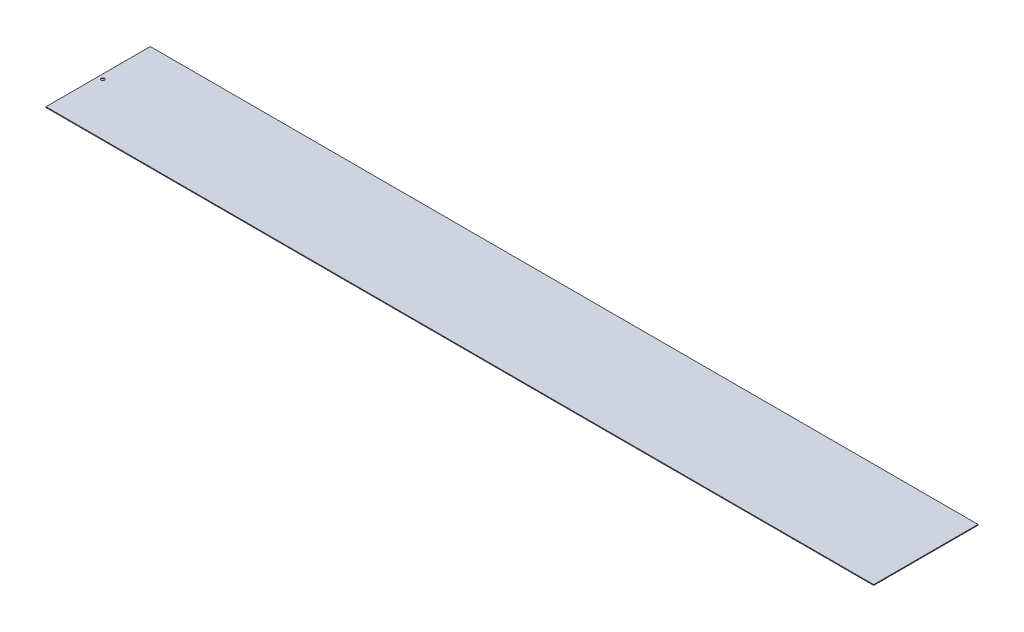
ISO-10303-21;
HEADER;
FILE_DESCRIPTION(('STEP AP214'),'2;1');
FILE_NAME('part.step','',(''),(''),'','','');
FILE_SCHEMA(('AUTOMOTIVE_DESIGN { 1 0 10303 214 1 1 1 1 }'));
ENDSEC;
DATA;
#1=APPLICATION_CONTEXT('core data for automotive mechanical design processes');
#2=APPLICATION_PROTOCOL_DEFINITION('international standard','automotive_design',2000,#1);
#3=PRODUCT_CONTEXT('',#1,'mechanical');
#4=PRODUCT('Part','Part','',(#3));
#5=PRODUCT_RELATED_PRODUCT_CATEGORY('part','',(#4));
#6=PRODUCT_DEFINITION_FORMATION('','',#4);
#7=PRODUCT_DEFINITION_CONTEXT('part definition',#1,'design');
#8=PRODUCT_DEFINITION('design','',#6,#7);
#9=PRODUCT_DEFINITION_SHAPE('','',#8);
#10=(LENGTH_UNIT() NAMED_UNIT(*) SI_UNIT(.MILLI.,.METRE.));
#11=(NAMED_UNIT(*) PLANE_ANGLE_UNIT() SI_UNIT($,.RADIAN.));
#12=(NAMED_UNIT(*) SI_UNIT($,.STERADIAN.) SOLID_ANGLE_UNIT());
#13=UNCERTAINTY_MEASURE_WITH_UNIT(LENGTH_MEASURE(1.E-05),#10,'distance_accuracy_value','');
#14=(GEOMETRIC_REPRESENTATION_CONTEXT(3) GLOBAL_UNCERTAINTY_ASSIGNED_CONTEXT((#13)) GLOBAL_UNIT_ASSIGNED_CONTEXT((#10,
#11,#12)) REPRESENTATION_CONTEXT('',''));
#15=CARTESIAN_POINT('',(0.,0.,0.));
#16=DIRECTION('',(0.,0.,1.));
#17=DIRECTION('',(1.,0.,0.));
#18=AXIS2_PLACEMENT_3D('',#15,#16,#17);
#19=CARTESIAN_POINT('',(475.728066955283,297.808823529412,200.));
#20=DIRECTION('',(0.,0.,-1.));
#21=DIRECTION('',(-1.,0.,0.));
#22=AXIS2_PLACEMENT_3D('',#19,#20,#21);
#23=PLANE('',#22);
#24=DIRECTION('',(-1.,0.,0.));
#25=VECTOR('',#24,1.);
#26=CARTESIAN_POINT('',(475.728066955283,298.558823529412,200.));
#27=LINE('',#26,#25);
#28=CARTESIAN_POINT('',(-293.006306293609,298.558823529412,200.));
#29=VERTEX_POINT('',#28);
#30=CARTESIAN_POINT('',(1294.40245047959,298.558823529412,200.));
#31=VERTEX_POINT('',#30);
#32=EDGE_CURVE('E64',#29,#31,#27,.F.);
#33=ORIENTED_EDGE('',*,*,#32,.F.);
#34=DIRECTION('',(0.,1.,0.));
#35=VECTOR('',#34,1.);
#36=CARTESIAN_POINT('',(-293.006306293609,298.558823529412,200.));
#37=LINE('',#36,#35);
#38=CARTESIAN_POINT('',(-293.006306293609,297.058823529412,200.));
#39=VERTEX_POINT('',#38);
#40=EDGE_CURVE('E133',#39,#29,#37,.T.);
#41=ORIENTED_EDGE('',*,*,#40,.F.);
#42=DIRECTION('',(-1.,0.,0.));
#43=VECTOR('',#42,1.);
#44=CARTESIAN_POINT('',(475.728066955283,297.058823529412,200.));
#45=LINE('',#44,#43);
#46=CARTESIAN_POINT('',(1294.40245047959,297.058823529412,200.));
#47=VERTEX_POINT('',#46);
#48=EDGE_CURVE('E90',#39,#47,#45,.F.);
#49=ORIENTED_EDGE('',*,*,#48,.T.);
#50=DIRECTION('',(0.,1.,0.));
#51=VECTOR('',#50,1.);
#52=CARTESIAN_POINT('',(1294.40245047959,297.808823529412,200.));
#53=LINE('',#52,#51);
#54=EDGE_CURVE('E139',#47,#31,#53,.T.);
#55=ORIENTED_EDGE('',*,*,#54,.T.);
#56=EDGE_LOOP('',(#33,#41,#49,#55));
#57=FACE_BOUND('',#56,.T.);
#58=ADVANCED_FACE('F53',(#57),#23,.F.);
#59=CARTESIAN_POINT('',(475.728066955283,297.808823529412,0.));
#60=DIRECTION('',(0.,0.,-1.));
#61=DIRECTION('',(-1.,0.,0.));
#62=AXIS2_PLACEMENT_3D('',#59,#60,#61);
#63=PLANE('',#62);
#64=DIRECTION('',(-1.,0.,0.));
#65=VECTOR('',#64,1.);
#66=CARTESIAN_POINT('',(475.728066955283,297.058823529412,0.));
#67=LINE('',#66,#65);
#68=CARTESIAN_POINT('',(1294.40245047959,297.058823529412,0.));
#69=VERTEX_POINT('',#68);
#70=CARTESIAN_POINT('',(-293.006306293609,297.058823529412,0.));
#71=VERTEX_POINT('',#70);
#72=EDGE_CURVE('E57',#69,#71,#67,.T.);
#73=ORIENTED_EDGE('',*,*,#72,.T.);
#74=DIRECTION('',(0.,1.,0.));
#75=VECTOR('',#74,1.);
#76=CARTESIAN_POINT('',(-293.006306293609,298.558823529412,0.));
#77=LINE('',#76,#75);
#78=CARTESIAN_POINT('',(-293.006306293609,298.558823529412,0.));
#79=VERTEX_POINT('',#78);
#80=EDGE_CURVE('E100',#71,#79,#77,.T.);
#81=ORIENTED_EDGE('',*,*,#80,.T.);
#82=DIRECTION('',(-1.,0.,0.));
#83=VECTOR('',#82,1.);
#84=CARTESIAN_POINT('',(475.728066955283,298.558823529412,0.));
#85=LINE('',#84,#83);
#86=CARTESIAN_POINT('',(1294.40245047959,298.558823529412,0.));
#87=VERTEX_POINT('',#86);
#88=EDGE_CURVE('E13',#87,#79,#85,.T.);
#89=ORIENTED_EDGE('',*,*,#88,.F.);
#90=DIRECTION('',(0.,1.,0.));
#91=VECTOR('',#90,1.);
#92=CARTESIAN_POINT('',(1294.40245047959,297.808823529412,0.));
#93=LINE('',#92,#91);
#94=EDGE_CURVE('E102',#69,#87,#93,.T.);
#95=ORIENTED_EDGE('',*,*,#94,.F.);
#96=EDGE_LOOP('',(#73,#81,#89,#95));
#97=FACE_BOUND('',#96,.T.);
#98=ADVANCED_FACE('F99',(#97),#63,.T.);
#99=CARTESIAN_POINT('',(-41.905314261103,298.558823529412,200.));
#100=DIRECTION('',(0.,-1.,0.));
#101=DIRECTION('',(1.,0.,0.));
#102=AXIS2_PLACEMENT_3D('',#99,#100,#101);
#103=PLANE('',#102);
#104=ORIENTED_EDGE('',*,*,#32,.T.);
#105=DIRECTION('',(0.,0.,1.));
#106=VECTOR('',#105,1.);
#107=CARTESIAN_POINT('',(1294.40245047959,298.558823529412,100.));
#108=LINE('',#107,#106);
#109=EDGE_CURVE('E142',#31,#87,#108,.F.);
#110=ORIENTED_EDGE('',*,*,#109,.T.);
#111=ORIENTED_EDGE('',*,*,#88,.T.);
#112=DIRECTION('',(0.,0.,-1.));
#113=VECTOR('',#112,1.);
#114=CARTESIAN_POINT('',(-293.006306293609,298.558823529412,200.));
#115=LINE('',#114,#113);
#116=EDGE_CURVE('E110',#29,#79,#115,.T.);
#117=ORIENTED_EDGE('',*,*,#116,.F.);
#118=EDGE_LOOP('',(#104,#110,#111,#117));
#119=FACE_BOUND('',#118,.T.);
#120=CARTESIAN_POINT('',(-284.006306293609,298.558823529412,100.));
#121=DIRECTION('',(0.,1.,0.));
#122=DIRECTION('',(0.,0.,1.));
#123=AXIS2_PLACEMENT_3D('',#120,#121,#122);
#124=CIRCLE('',#123,3.25000000000001);
#125=CARTESIAN_POINT('',(-284.006306293609,298.558823529412,103.25));
#126=VERTEX_POINT('',#125);
#127=EDGE_CURVE('E113',#126,#126,#124,.T.);
#128=ORIENTED_EDGE('',*,*,#127,.F.);
#129=EDGE_LOOP('',(#128));
#130=FACE_BOUND('',#129,.T.);
#131=ADVANCED_FACE('F55',(#119,#130),#103,.F.);
#132=CARTESIAN_POINT('',(475.728066955283,297.058823529412,100.));
#133=DIRECTION('',(0.,1.,0.));
#134=DIRECTION('',(-1.,0.,0.));
#135=AXIS2_PLACEMENT_3D('',#132,#133,#134);
#136=PLANE('',#135);
#137=ORIENTED_EDGE('',*,*,#72,.F.);
#138=DIRECTION('',(0.,0.,1.));
#139=VECTOR('',#138,1.);
#140=CARTESIAN_POINT('',(1294.40245047959,297.058823529412,100.));
#141=LINE('',#140,#139);
#142=EDGE_CURVE('E118',#47,#69,#141,.F.);
#143=ORIENTED_EDGE('',*,*,#142,.F.);
#144=ORIENTED_EDGE('',*,*,#48,.F.);
#145=DIRECTION('',(0.,0.,1.));
#146=VECTOR('',#145,1.);
#147=CARTESIAN_POINT('',(-293.006306293609,297.058823529412,200.));
#148=LINE('',#147,#146);
#149=EDGE_CURVE('E108',#39,#71,#148,.F.);
#150=ORIENTED_EDGE('',*,*,#149,.T.);
#151=EDGE_LOOP('',(#137,#143,#144,#150));
#152=FACE_BOUND('',#151,.T.);
#153=CARTESIAN_POINT('',(-284.006306293609,297.058823529412,100.));
#154=DIRECTION('',(0.,1.,0.));
#155=DIRECTION('',(0.,0.,1.));
#156=AXIS2_PLACEMENT_3D('',#153,#154,#155);
#157=CIRCLE('',#156,3.25000000000001);
#158=CARTESIAN_POINT('',(-284.006306293609,297.058823529412,103.25));
#159=VERTEX_POINT('',#158);
#160=EDGE_CURVE('E112',#159,#159,#157,.T.);
#161=ORIENTED_EDGE('',*,*,#160,.T.);
#162=EDGE_LOOP('',(#161));
#163=FACE_BOUND('',#162,.T.);
#164=ADVANCED_FACE('F115',(#152,#163),#136,.F.);
#165=CARTESIAN_POINT('',(1294.40245047959,297.808823529412,100.));
#166=DIRECTION('',(-1.,0.,0.));
#167=DIRECTION('',(0.,0.,1.));
#168=AXIS2_PLACEMENT_3D('',#165,#166,#167);
#169=PLANE('',#168);
#170=ORIENTED_EDGE('',*,*,#54,.F.);
#171=ORIENTED_EDGE('',*,*,#142,.T.);
#172=ORIENTED_EDGE('',*,*,#94,.T.);
#173=ORIENTED_EDGE('',*,*,#109,.F.);
#174=EDGE_LOOP('',(#170,#171,#172,#173));
#175=FACE_BOUND('',#174,.T.);
#176=ADVANCED_FACE('F153',(#175),#169,.F.);
#177=CARTESIAN_POINT('',(-293.006306293609,298.558823529412,200.));
#178=DIRECTION('',(-1.,0.,0.));
#179=DIRECTION('',(0.,0.,-1.));
#180=AXIS2_PLACEMENT_3D('',#177,#178,#179);
#181=PLANE('',#180);
#182=ORIENTED_EDGE('',*,*,#80,.F.);
#183=ORIENTED_EDGE('',*,*,#149,.F.);
#184=ORIENTED_EDGE('',*,*,#40,.T.);
#185=ORIENTED_EDGE('',*,*,#116,.T.);
#186=EDGE_LOOP('',(#182,#183,#184,#185));
#187=FACE_BOUND('',#186,.T.);
#188=ADVANCED_FACE('F107',(#187),#181,.T.);
#189=CARTESIAN_POINT('',(-284.006306293609,298.558823529412,100.));
#190=DIRECTION('',(0.,-1.,0.));
#191=DIRECTION('',(1.,0.,0.));
#192=AXIS2_PLACEMENT_3D('',#189,#190,#191);
#193=CYLINDRICAL_SURFACE('',#192,3.25000000000001);
#194=ORIENTED_EDGE('',*,*,#127,.T.);
#195=EDGE_LOOP('',(#194));
#196=FACE_BOUND('',#195,.T.);
#197=ORIENTED_EDGE('',*,*,#160,.F.);
#198=EDGE_LOOP('',(#197));
#199=FACE_BOUND('',#198,.T.);
#200=ADVANCED_FACE('F180',(#196,#199),#193,.F.);
#201=CLOSED_SHELL('',(#58,#98,#131,#164,#176,#188,#200));
#202=MANIFOLD_SOLID_BREP('B2',#201);
#203=ADVANCED_BREP_SHAPE_REPRESENTATION('',(#18,#202),#14);
#204=SHAPE_DEFINITION_REPRESENTATION(#9,#203);
ENDSEC;
END-ISO-10303-21;
